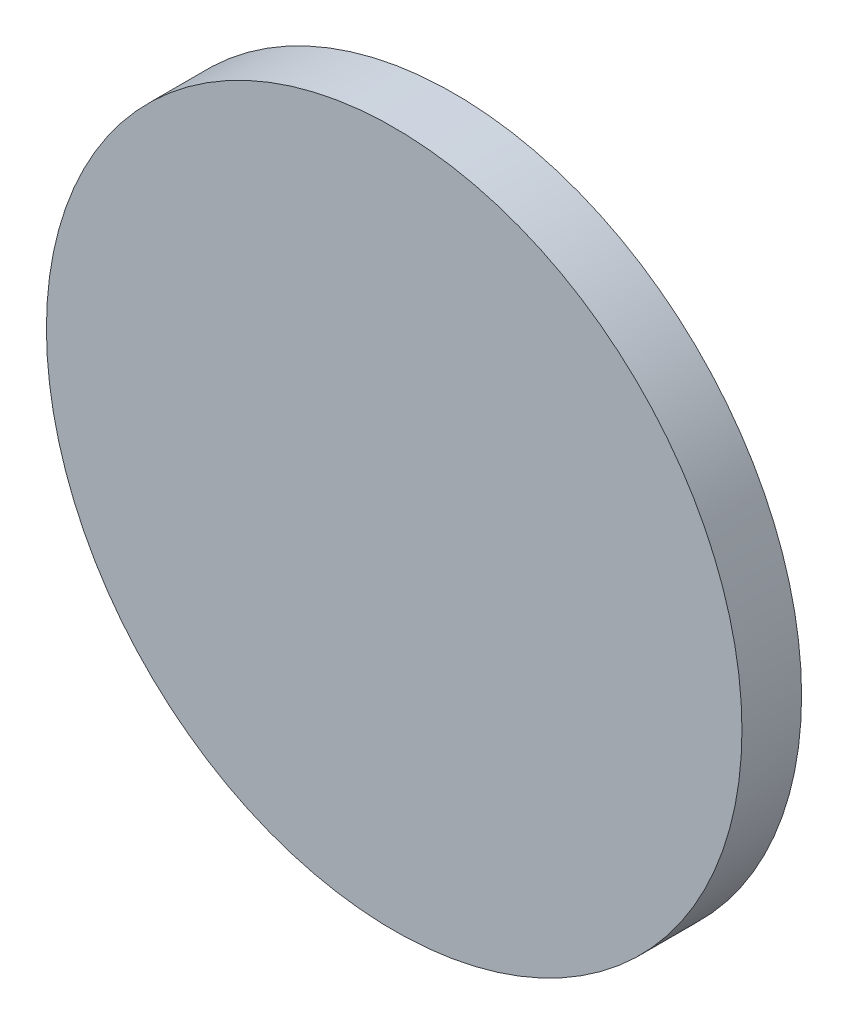
ISO-10303-21;
HEADER;
FILE_DESCRIPTION(('STEP AP214'),'2;1');
FILE_NAME('part.step','',(''),(''),'','','');
FILE_SCHEMA(('AUTOMOTIVE_DESIGN { 1 0 10303 214 1 1 1 1 }'));
ENDSEC;
DATA;
#1=APPLICATION_CONTEXT('core data for automotive mechanical design processes');
#2=APPLICATION_PROTOCOL_DEFINITION('international standard','automotive_design',2000,#1);
#3=PRODUCT_CONTEXT('',#1,'mechanical');
#4=PRODUCT('Part','Part','',(#3));
#5=PRODUCT_RELATED_PRODUCT_CATEGORY('part','',(#4));
#6=PRODUCT_DEFINITION_FORMATION('','',#4);
#7=PRODUCT_DEFINITION_CONTEXT('part definition',#1,'design');
#8=PRODUCT_DEFINITION('design','',#6,#7);
#9=PRODUCT_DEFINITION_SHAPE('','',#8);
#10=(LENGTH_UNIT() NAMED_UNIT(*) SI_UNIT(.MILLI.,.METRE.));
#11=(NAMED_UNIT(*) PLANE_ANGLE_UNIT() SI_UNIT($,.RADIAN.));
#12=(NAMED_UNIT(*) SI_UNIT($,.STERADIAN.) SOLID_ANGLE_UNIT());
#13=UNCERTAINTY_MEASURE_WITH_UNIT(LENGTH_MEASURE(1.E-05),#10,'distance_accuracy_value','');
#14=(GEOMETRIC_REPRESENTATION_CONTEXT(3) GLOBAL_UNCERTAINTY_ASSIGNED_CONTEXT((#13)) GLOBAL_UNIT_ASSIGNED_CONTEXT((#10,
#11,#12)) REPRESENTATION_CONTEXT('',''));
#15=CARTESIAN_POINT('',(0.,0.,0.));
#16=DIRECTION('',(0.,0.,1.));
#17=DIRECTION('',(1.,0.,0.));
#18=AXIS2_PLACEMENT_3D('',#15,#16,#17);
#19=CARTESIAN_POINT('',(9.551,3.339000014875,0.76487));
#20=DIRECTION('',(0.,0.,-1.));
#21=DIRECTION('',(-1.,0.,0.));
#22=AXIS2_PLACEMENT_3D('',#19,#20,#21);
#23=PLANE('',#22);
#24=CARTESIAN_POINT('',(9.551,3.339000014875,0.76487));
#25=DIRECTION('',(0.,0.,1.));
#26=DIRECTION('',(1.,0.,0.));
#27=AXIS2_PLACEMENT_3D('',#24,#25,#26);
#28=CIRCLE('',#27,0.200024667);
#29=CARTESIAN_POINT('',(9.751024667,3.339000014875,0.76487));
#30=VERTEX_POINT('',#29);
#31=EDGE_CURVE('E18',#30,#30,#28,.T.);
#32=ORIENTED_EDGE('',*,*,#31,.F.);
#33=EDGE_LOOP('',(#32));
#34=FACE_BOUND('',#33,.T.);
#35=ADVANCED_FACE('F15',(#34),#23,.T.);
#36=CARTESIAN_POINT('',(9.551,3.339000014875,0.76487));
#37=DIRECTION('',(0.,0.,1.));
#38=DIRECTION('',(1.,0.,0.));
#39=AXIS2_PLACEMENT_3D('',#36,#37,#38);
#40=CYLINDRICAL_SURFACE('',#39,0.200024667);
#41=CARTESIAN_POINT('',(9.551,3.339000014875,0.79916));
#42=DIRECTION('',(0.,0.,1.));
#43=DIRECTION('',(1.,0.,0.));
#44=AXIS2_PLACEMENT_3D('',#41,#42,#43);
#45=CIRCLE('',#44,0.200024667);
#46=CARTESIAN_POINT('',(9.751024667,3.339000014875,0.79916));
#47=VERTEX_POINT('',#46);
#48=EDGE_CURVE('E10',#47,#47,#45,.T.);
#49=ORIENTED_EDGE('',*,*,#48,.F.);
#50=EDGE_LOOP('',(#49));
#51=FACE_BOUND('',#50,.T.);
#52=ORIENTED_EDGE('',*,*,#31,.T.);
#53=EDGE_LOOP('',(#52));
#54=FACE_BOUND('',#53,.T.);
#55=ADVANCED_FACE('F27',(#51,#54),#40,.T.);
#56=CARTESIAN_POINT('',(9.551,3.339000014875,0.79916));
#57=DIRECTION('',(0.,0.,1.));
#58=DIRECTION('',(1.,0.,0.));
#59=AXIS2_PLACEMENT_3D('',#56,#57,#58);
#60=PLANE('',#59);
#61=ORIENTED_EDGE('',*,*,#48,.T.);
#62=EDGE_LOOP('',(#61));
#63=FACE_BOUND('',#62,.T.);
#64=ADVANCED_FACE('F34',(#63),#60,.T.);
#65=CLOSED_SHELL('',(#35,#55,#64));
#66=MANIFOLD_SOLID_BREP('B1',#65);
#67=ADVANCED_BREP_SHAPE_REPRESENTATION('',(#18,#66),#14);
#68=SHAPE_DEFINITION_REPRESENTATION(#9,#67);
ENDSEC;
END-ISO-10303-21;
